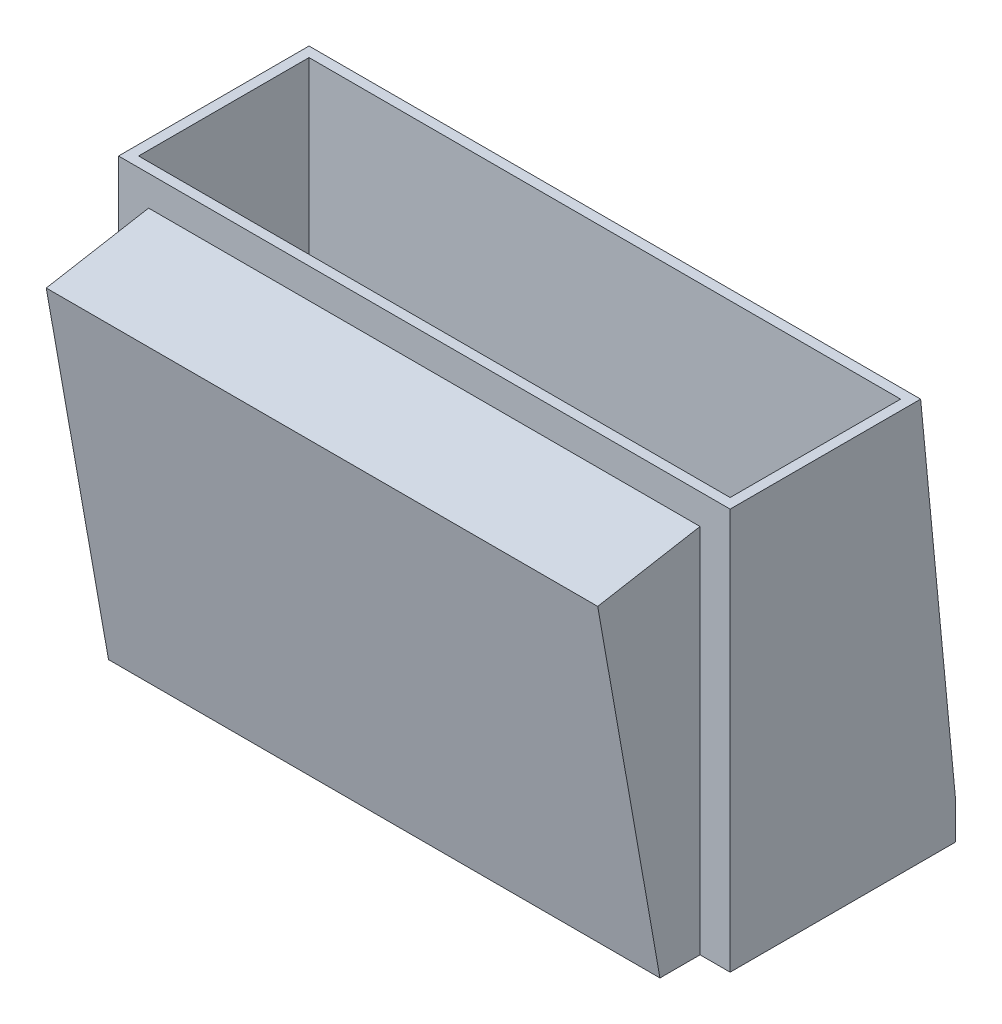
ISO-10303-21;
HEADER;
FILE_DESCRIPTION(('STEP AP214'),'2;1');
FILE_NAME('part.step','',(''),(''),'','','');
FILE_SCHEMA(('AUTOMOTIVE_DESIGN { 1 0 10303 214 1 1 1 1 }'));
ENDSEC;
DATA;
#1=APPLICATION_CONTEXT('core data for automotive mechanical design processes');
#2=APPLICATION_PROTOCOL_DEFINITION('international standard','automotive_design',2000,#1);
#3=PRODUCT_CONTEXT('',#1,'mechanical');
#4=PRODUCT('Part','Part','',(#3));
#5=PRODUCT_RELATED_PRODUCT_CATEGORY('part','',(#4));
#6=PRODUCT_DEFINITION_FORMATION('','',#4);
#7=PRODUCT_DEFINITION_CONTEXT('part definition',#1,'design');
#8=PRODUCT_DEFINITION('design','',#6,#7);
#9=PRODUCT_DEFINITION_SHAPE('','',#8);
#10=(LENGTH_UNIT() NAMED_UNIT(*) SI_UNIT(.MILLI.,.METRE.));
#11=(NAMED_UNIT(*) PLANE_ANGLE_UNIT() SI_UNIT($,.RADIAN.));
#12=(NAMED_UNIT(*) SI_UNIT($,.STERADIAN.) SOLID_ANGLE_UNIT());
#13=UNCERTAINTY_MEASURE_WITH_UNIT(LENGTH_MEASURE(1.E-05),#10,'distance_accuracy_value','');
#14=(GEOMETRIC_REPRESENTATION_CONTEXT(3) GLOBAL_UNCERTAINTY_ASSIGNED_CONTEXT((#13)) GLOBAL_UNIT_ASSIGNED_CONTEXT((#10,
#11,#12)) REPRESENTATION_CONTEXT('',''));
#15=CARTESIAN_POINT('',(0.,0.,0.));
#16=DIRECTION('',(0.,0.,1.));
#17=DIRECTION('',(1.,0.,0.));
#18=AXIS2_PLACEMENT_3D('',#15,#16,#17);
#19=CARTESIAN_POINT('',(35.3264165129139,18.7544545826681,3.30691635139591));
#20=DIRECTION('',(0.,0.984807753012208,0.173648177666931));
#21=DIRECTION('',(0.,-0.173648177666931,0.984807753012208));
#22=AXIS2_PLACEMENT_3D('',#19,#20,#21);
#23=PLANE('',#22);
#24=DIRECTION('',(-1.,0.,0.));
#25=VECTOR('',#24,1.);
#26=CARTESIAN_POINT('',(35.3264165129139,17.600136598944,9.85337894654835));
#27=LINE('',#26,#25);
#28=CARTESIAN_POINT('',(13.75,17.600136598944,9.85337894654835));
#29=VERTEX_POINT('',#28);
#30=CARTESIAN_POINT('',(-13.75,17.600136598944,9.85337894654835));
#31=VERTEX_POINT('',#30);
#32=EDGE_CURVE('E145',#29,#31,#27,.T.);
#33=ORIENTED_EDGE('',*,*,#32,.F.);
#34=DIRECTION('',(0.,0.17364817766693,-0.984807753012208));
#35=VECTOR('',#34,1.);
#36=CARTESIAN_POINT('',(13.75,18.5,4.75));
#37=LINE('',#36,#35);
#38=CARTESIAN_POINT('',(13.75,18.5,4.75));
#39=VERTEX_POINT('',#38);
#40=EDGE_CURVE('E133',#29,#39,#37,.T.);
#41=ORIENTED_EDGE('',*,*,#40,.T.);
#42=DIRECTION('',(-1.,0.,0.));
#43=VECTOR('',#42,1.);
#44=CARTESIAN_POINT('',(35.3264165129139,18.5,4.75));
#45=LINE('',#44,#43);
#46=CARTESIAN_POINT('',(-13.75,18.5,4.75));
#47=VERTEX_POINT('',#46);
#48=EDGE_CURVE('E143',#39,#47,#45,.T.);
#49=ORIENTED_EDGE('',*,*,#48,.T.);
#50=DIRECTION('',(0.,0.17364817766693,-0.984807753012208));
#51=VECTOR('',#50,1.);
#52=CARTESIAN_POINT('',(-13.75,18.5,4.75));
#53=LINE('',#52,#51);
#54=EDGE_CURVE('E281',#31,#47,#53,.T.);
#55=ORIENTED_EDGE('',*,*,#54,.F.);
#56=EDGE_LOOP('',(#33,#41,#49,#55));
#57=FACE_BOUND('',#56,.T.);
#58=ADVANCED_FACE('F35',(#57),#23,.T.);
#59=CARTESIAN_POINT('',(35.3264165129139,-1.15431798372413,6.54646259515244));
#60=DIRECTION('',(0.,-0.173648177666931,0.984807753012208));
#61=DIRECTION('',(0.,-0.984807753012208,-0.173648177666931));
#62=AXIS2_PLACEMENT_3D('',#59,#60,#61);
#63=PLANE('',#62);
#64=DIRECTION('',(-1.,0.,0.));
#65=VECTOR('',#64,1.);
#66=CARTESIAN_POINT('',(35.3264165129139,0.,6.75));
#67=LINE('',#66,#65);
#68=CARTESIAN_POINT('',(13.75,0.,6.75));
#69=VERTEX_POINT('',#68);
#70=CARTESIAN_POINT('',(-13.75,0.,6.75));
#71=VERTEX_POINT('',#70);
#72=EDGE_CURVE('E59',#69,#71,#67,.T.);
#73=ORIENTED_EDGE('',*,*,#72,.F.);
#74=DIRECTION('',(0.,0.984807753012208,0.173648177666931));
#75=VECTOR('',#74,1.);
#76=CARTESIAN_POINT('',(13.75,17.600136598944,9.85337894654835));
#77=LINE('',#76,#75);
#78=EDGE_CURVE('E52',#69,#29,#77,.T.);
#79=ORIENTED_EDGE('',*,*,#78,.T.);
#80=ORIENTED_EDGE('',*,*,#32,.T.);
#81=DIRECTION('',(0.,0.984807753012208,0.173648177666931));
#82=VECTOR('',#81,1.);
#83=CARTESIAN_POINT('',(-13.75,17.600136598944,9.85337894654835));
#84=LINE('',#83,#82);
#85=EDGE_CURVE('E283',#71,#31,#84,.T.);
#86=ORIENTED_EDGE('',*,*,#85,.F.);
#87=EDGE_LOOP('',(#73,#79,#80,#86));
#88=FACE_BOUND('',#87,.T.);
#89=ADVANCED_FACE('F231',(#88),#63,.T.);
#90=CARTESIAN_POINT('',(15.25,20.,0.));
#91=DIRECTION('',(1.,0.,0.));
#92=DIRECTION('',(0.,0.,-1.));
#93=AXIS2_PLACEMENT_3D('',#90,#91,#92);
#94=PLANE('',#93);
#95=DIRECTION('',(0.,-1.,0.));
#96=VECTOR('',#95,1.);
#97=CARTESIAN_POINT('',(15.25,20.,4.75));
#98=LINE('',#97,#96);
#99=CARTESIAN_POINT('',(15.25,20.,4.75));
#100=VERTEX_POINT('',#99);
#101=CARTESIAN_POINT('',(15.25,0.,4.75));
#102=VERTEX_POINT('',#101);
#103=EDGE_CURVE('E44',#100,#102,#98,.T.);
#104=ORIENTED_EDGE('',*,*,#103,.T.);
#105=DIRECTION('',(0.,0.,1.));
#106=VECTOR('',#105,1.);
#107=CARTESIAN_POINT('',(15.25,0.,0.));
#108=LINE('',#107,#106);
#109=CARTESIAN_POINT('',(15.25,0.,-6.5));
#110=VERTEX_POINT('',#109);
#111=EDGE_CURVE('E163',#110,#102,#108,.T.);
#112=ORIENTED_EDGE('',*,*,#111,.F.);
#113=DIRECTION('',(0.,1.,0.));
#114=VECTOR('',#113,1.);
#115=CARTESIAN_POINT('',(15.25,0.,-6.5));
#116=LINE('',#115,#114);
#117=CARTESIAN_POINT('',(15.25,1.75,-6.5));
#118=VERTEX_POINT('',#117);
#119=EDGE_CURVE('E155',#110,#118,#116,.T.);
#120=ORIENTED_EDGE('',*,*,#119,.T.);
#121=DIRECTION('',(0.,0.995433978849263,0.0954525733143129));
#122=VECTOR('',#121,1.);
#123=CARTESIAN_POINT('',(15.25,0.633553365563406,-6.60705652658981));
#124=LINE('',#123,#122);
#125=CARTESIAN_POINT('',(15.25,20.,-4.75));
#126=VERTEX_POINT('',#125);
#127=EDGE_CURVE('E151',#118,#126,#124,.T.);
#128=ORIENTED_EDGE('',*,*,#127,.T.);
#129=DIRECTION('',(0.,0.,1.));
#130=VECTOR('',#129,1.);
#131=CARTESIAN_POINT('',(15.25,20.,0.));
#132=LINE('',#131,#130);
#133=EDGE_CURVE('E179',#126,#100,#132,.T.);
#134=ORIENTED_EDGE('',*,*,#133,.T.);
#135=EDGE_LOOP('',(#104,#112,#120,#128,#134));
#136=FACE_BOUND('',#135,.T.);
#137=ADVANCED_FACE('F236',(#136),#94,.T.);
#138=CARTESIAN_POINT('',(0.,0.,0.));
#139=DIRECTION('',(0.,1.,0.));
#140=DIRECTION('',(0.,0.,1.));
#141=AXIS2_PLACEMENT_3D('',#138,#139,#140);
#142=PLANE('',#141);
#143=DIRECTION('',(1.,0.,0.));
#144=VECTOR('',#143,1.);
#145=CARTESIAN_POINT('',(0.,0.,-4.25));
#146=LINE('',#145,#144);
#147=CARTESIAN_POINT('',(-14.75,0.,-4.25));
#148=VERTEX_POINT('',#147);
#149=CARTESIAN_POINT('',(14.75,0.,-4.25));
#150=VERTEX_POINT('',#149);
#151=EDGE_CURVE('E183',#148,#150,#146,.T.);
#152=ORIENTED_EDGE('',*,*,#151,.F.);
#153=DIRECTION('',(0.,0.,1.));
#154=VECTOR('',#153,1.);
#155=CARTESIAN_POINT('',(-14.75,0.,0.));
#156=LINE('',#155,#154);
#157=CARTESIAN_POINT('',(-14.75,0.,4.25));
#158=VERTEX_POINT('',#157);
#159=EDGE_CURVE('E192',#148,#158,#156,.T.);
#160=ORIENTED_EDGE('',*,*,#159,.T.);
#161=DIRECTION('',(1.,0.,0.));
#162=VECTOR('',#161,1.);
#163=CARTESIAN_POINT('',(0.,0.,4.25));
#164=LINE('',#163,#162);
#165=CARTESIAN_POINT('',(14.75,0.,4.25));
#166=VERTEX_POINT('',#165);
#167=EDGE_CURVE('E189',#158,#166,#164,.T.);
#168=ORIENTED_EDGE('',*,*,#167,.T.);
#169=DIRECTION('',(0.,0.,1.));
#170=VECTOR('',#169,1.);
#171=CARTESIAN_POINT('',(14.75,0.,0.));
#172=LINE('',#171,#170);
#173=EDGE_CURVE('E186',#150,#166,#172,.T.);
#174=ORIENTED_EDGE('',*,*,#173,.F.);
#175=EDGE_LOOP('',(#152,#160,#168,#174));
#176=FACE_BOUND('',#175,.T.);
#177=DIRECTION('',(1.,0.,0.));
#178=VECTOR('',#177,1.);
#179=CARTESIAN_POINT('',(13.75,0.,4.75));
#180=LINE('',#179,#178);
#181=CARTESIAN_POINT('',(13.75,0.,4.75));
#182=VERTEX_POINT('',#181);
#183=EDGE_CURVE('E291',#182,#102,#180,.T.);
#184=ORIENTED_EDGE('',*,*,#183,.F.);
#185=DIRECTION('',(0.,0.,1.));
#186=VECTOR('',#185,1.);
#187=CARTESIAN_POINT('',(13.75,0.,6.75));
#188=LINE('',#187,#186);
#189=EDGE_CURVE('E134',#182,#69,#188,.T.);
#190=ORIENTED_EDGE('',*,*,#189,.T.);
#191=ORIENTED_EDGE('',*,*,#72,.T.);
#192=DIRECTION('',(0.,0.,1.));
#193=VECTOR('',#192,1.);
#194=CARTESIAN_POINT('',(-13.75,0.,6.75));
#195=LINE('',#194,#193);
#196=CARTESIAN_POINT('',(-13.75,0.,4.75));
#197=VERTEX_POINT('',#196);
#198=EDGE_CURVE('E288',#197,#71,#195,.T.);
#199=ORIENTED_EDGE('',*,*,#198,.F.);
#200=DIRECTION('',(-1.,0.,0.));
#201=VECTOR('',#200,1.);
#202=CARTESIAN_POINT('',(-13.75,0.,4.75));
#203=LINE('',#202,#201);
#204=CARTESIAN_POINT('',(-15.25,0.,4.75));
#205=VERTEX_POINT('',#204);
#206=EDGE_CURVE('E267',#197,#205,#203,.T.);
#207=ORIENTED_EDGE('',*,*,#206,.T.);
#208=DIRECTION('',(0.,0.,1.));
#209=VECTOR('',#208,1.);
#210=CARTESIAN_POINT('',(-15.25,0.,0.));
#211=LINE('',#210,#209);
#212=CARTESIAN_POINT('',(-15.25,0.,-6.5));
#213=VERTEX_POINT('',#212);
#214=EDGE_CURVE('E195',#213,#205,#211,.T.);
#215=ORIENTED_EDGE('',*,*,#214,.F.);
#216=DIRECTION('',(-1.,0.,0.));
#217=VECTOR('',#216,1.);
#218=CARTESIAN_POINT('',(35.3264165129139,0.,-6.5));
#219=LINE('',#218,#217);
#220=EDGE_CURVE('E265',#110,#213,#219,.T.);
#221=ORIENTED_EDGE('',*,*,#220,.F.);
#222=ORIENTED_EDGE('',*,*,#111,.T.);
#223=EDGE_LOOP('',(#184,#190,#191,#199,#207,#215,#221,#222));
#224=FACE_BOUND('',#223,.T.);
#225=ADVANCED_FACE('F216',(#176,#224),#142,.F.);
#226=CARTESIAN_POINT('',(-15.25,20.,0.));
#227=DIRECTION('',(1.,0.,0.));
#228=DIRECTION('',(0.,0.,-1.));
#229=AXIS2_PLACEMENT_3D('',#226,#227,#228);
#230=PLANE('',#229);
#231=ORIENTED_EDGE('',*,*,#214,.T.);
#232=DIRECTION('',(0.,-1.,0.));
#233=VECTOR('',#232,1.);
#234=CARTESIAN_POINT('',(-15.25,20.,4.75));
#235=LINE('',#234,#233);
#236=CARTESIAN_POINT('',(-15.25,20.,4.75));
#237=VERTEX_POINT('',#236);
#238=EDGE_CURVE('E11',#237,#205,#235,.T.);
#239=ORIENTED_EDGE('',*,*,#238,.F.);
#240=DIRECTION('',(0.,0.,1.));
#241=VECTOR('',#240,1.);
#242=CARTESIAN_POINT('',(-15.25,20.,0.));
#243=LINE('',#242,#241);
#244=CARTESIAN_POINT('',(-15.25,20.,-4.75));
#245=VERTEX_POINT('',#244);
#246=EDGE_CURVE('E174',#245,#237,#243,.T.);
#247=ORIENTED_EDGE('',*,*,#246,.F.);
#248=DIRECTION('',(0.,0.995433978849263,0.0954525733143129));
#249=VECTOR('',#248,1.);
#250=CARTESIAN_POINT('',(-15.25,0.633553365563406,-6.60705652658981));
#251=LINE('',#250,#249);
#252=CARTESIAN_POINT('',(-15.25,1.75,-6.5));
#253=VERTEX_POINT('',#252);
#254=EDGE_CURVE('E271',#253,#245,#251,.T.);
#255=ORIENTED_EDGE('',*,*,#254,.F.);
#256=DIRECTION('',(0.,1.,0.));
#257=VECTOR('',#256,1.);
#258=CARTESIAN_POINT('',(-15.25,0.,-6.5));
#259=LINE('',#258,#257);
#260=EDGE_CURVE('E261',#213,#253,#259,.T.);
#261=ORIENTED_EDGE('',*,*,#260,.F.);
#262=EDGE_LOOP('',(#231,#239,#247,#255,#261));
#263=FACE_BOUND('',#262,.T.);
#264=ADVANCED_FACE('F247',(#263),#230,.F.);
#265=CARTESIAN_POINT('',(0.,20.,4.75));
#266=DIRECTION('',(0.,0.,1.));
#267=DIRECTION('',(1.,0.,0.));
#268=AXIS2_PLACEMENT_3D('',#265,#266,#267);
#269=PLANE('',#268);
#270=ORIENTED_EDGE('',*,*,#48,.F.);
#271=DIRECTION('',(0.,-1.,0.));
#272=VECTOR('',#271,1.);
#273=CARTESIAN_POINT('',(13.75,0.,4.75));
#274=LINE('',#273,#272);
#275=EDGE_CURVE('E130',#39,#182,#274,.T.);
#276=ORIENTED_EDGE('',*,*,#275,.T.);
#277=ORIENTED_EDGE('',*,*,#183,.T.);
#278=ORIENTED_EDGE('',*,*,#103,.F.);
#279=DIRECTION('',(-1.,0.,0.));
#280=VECTOR('',#279,1.);
#281=CARTESIAN_POINT('',(0.,20.,4.75));
#282=LINE('',#281,#280);
#283=EDGE_CURVE('E176',#100,#237,#282,.T.);
#284=ORIENTED_EDGE('',*,*,#283,.T.);
#285=ORIENTED_EDGE('',*,*,#238,.T.);
#286=ORIENTED_EDGE('',*,*,#206,.F.);
#287=DIRECTION('',(0.,-1.,0.));
#288=VECTOR('',#287,1.);
#289=CARTESIAN_POINT('',(-13.75,0.,4.75));
#290=LINE('',#289,#288);
#291=EDGE_CURVE('E149',#47,#197,#290,.T.);
#292=ORIENTED_EDGE('',*,*,#291,.F.);
#293=EDGE_LOOP('',(#270,#276,#277,#278,#284,#285,#286,#292));
#294=FACE_BOUND('',#293,.T.);
#295=ADVANCED_FACE('F147',(#294),#269,.T.);
#296=CARTESIAN_POINT('',(0.,20.,-4.25));
#297=DIRECTION('',(0.,0.,-1.));
#298=DIRECTION('',(-1.,0.,0.));
#299=AXIS2_PLACEMENT_3D('',#296,#297,#298);
#300=PLANE('',#299);
#301=ORIENTED_EDGE('',*,*,#151,.T.);
#302=DIRECTION('',(0.,-1.,0.));
#303=VECTOR('',#302,1.);
#304=CARTESIAN_POINT('',(14.75,20.,-4.25));
#305=LINE('',#304,#303);
#306=CARTESIAN_POINT('',(14.75,20.,-4.25));
#307=VERTEX_POINT('',#306);
#308=EDGE_CURVE('E39',#307,#150,#305,.T.);
#309=ORIENTED_EDGE('',*,*,#308,.F.);
#310=DIRECTION('',(1.,0.,0.));
#311=VECTOR('',#310,1.);
#312=CARTESIAN_POINT('',(0.,20.,-4.25));
#313=LINE('',#312,#311);
#314=CARTESIAN_POINT('',(-14.75,20.,-4.25));
#315=VERTEX_POINT('',#314);
#316=EDGE_CURVE('E159',#315,#307,#313,.T.);
#317=ORIENTED_EDGE('',*,*,#316,.F.);
#318=DIRECTION('',(0.,-1.,0.));
#319=VECTOR('',#318,1.);
#320=CARTESIAN_POINT('',(-14.75,20.,-4.25));
#321=LINE('',#320,#319);
#322=EDGE_CURVE('E182',#315,#148,#321,.T.);
#323=ORIENTED_EDGE('',*,*,#322,.T.);
#324=EDGE_LOOP('',(#301,#309,#317,#323));
#325=FACE_BOUND('',#324,.T.);
#326=ADVANCED_FACE('F37',(#325),#300,.F.);
#327=CARTESIAN_POINT('',(14.75,20.,0.));
#328=DIRECTION('',(1.,0.,0.));
#329=DIRECTION('',(0.,0.,-1.));
#330=AXIS2_PLACEMENT_3D('',#327,#328,#329);
#331=PLANE('',#330);
#332=ORIENTED_EDGE('',*,*,#173,.T.);
#333=DIRECTION('',(0.,-1.,0.));
#334=VECTOR('',#333,1.);
#335=CARTESIAN_POINT('',(14.75,20.,4.25));
#336=LINE('',#335,#334);
#337=CARTESIAN_POINT('',(14.75,20.,4.25));
#338=VERTEX_POINT('',#337);
#339=EDGE_CURVE('E203',#338,#166,#336,.T.);
#340=ORIENTED_EDGE('',*,*,#339,.F.);
#341=DIRECTION('',(0.,0.,1.));
#342=VECTOR('',#341,1.);
#343=CARTESIAN_POINT('',(14.75,20.,0.));
#344=LINE('',#343,#342);
#345=EDGE_CURVE('E162',#307,#338,#344,.T.);
#346=ORIENTED_EDGE('',*,*,#345,.F.);
#347=ORIENTED_EDGE('',*,*,#308,.T.);
#348=EDGE_LOOP('',(#332,#340,#346,#347));
#349=FACE_BOUND('',#348,.T.);
#350=ADVANCED_FACE('F210',(#349),#331,.F.);
#351=CARTESIAN_POINT('',(0.,20.,4.25));
#352=DIRECTION('',(0.,0.,-1.));
#353=DIRECTION('',(-1.,0.,0.));
#354=AXIS2_PLACEMENT_3D('',#351,#352,#353);
#355=PLANE('',#354);
#356=ORIENTED_EDGE('',*,*,#167,.F.);
#357=DIRECTION('',(0.,-1.,0.));
#358=VECTOR('',#357,1.);
#359=CARTESIAN_POINT('',(-14.75,20.,4.25));
#360=LINE('',#359,#358);
#361=CARTESIAN_POINT('',(-14.75,20.,4.25));
#362=VERTEX_POINT('',#361);
#363=EDGE_CURVE('E202',#362,#158,#360,.T.);
#364=ORIENTED_EDGE('',*,*,#363,.F.);
#365=DIRECTION('',(1.,0.,0.));
#366=VECTOR('',#365,1.);
#367=CARTESIAN_POINT('',(0.,20.,4.25));
#368=LINE('',#367,#366);
#369=EDGE_CURVE('E165',#362,#338,#368,.T.);
#370=ORIENTED_EDGE('',*,*,#369,.T.);
#371=ORIENTED_EDGE('',*,*,#339,.T.);
#372=EDGE_LOOP('',(#356,#364,#370,#371));
#373=FACE_BOUND('',#372,.T.);
#374=ADVANCED_FACE('F221',(#373),#355,.T.);
#375=CARTESIAN_POINT('',(-14.75,20.,0.));
#376=DIRECTION('',(1.,0.,0.));
#377=DIRECTION('',(0.,0.,-1.));
#378=AXIS2_PLACEMENT_3D('',#375,#376,#377);
#379=PLANE('',#378);
#380=ORIENTED_EDGE('',*,*,#159,.F.);
#381=ORIENTED_EDGE('',*,*,#322,.F.);
#382=DIRECTION('',(0.,0.,1.));
#383=VECTOR('',#382,1.);
#384=CARTESIAN_POINT('',(-14.75,20.,0.));
#385=LINE('',#384,#383);
#386=EDGE_CURVE('E168',#315,#362,#385,.T.);
#387=ORIENTED_EDGE('',*,*,#386,.T.);
#388=ORIENTED_EDGE('',*,*,#363,.T.);
#389=EDGE_LOOP('',(#380,#381,#387,#388));
#390=FACE_BOUND('',#389,.T.);
#391=ADVANCED_FACE('F218',(#390),#379,.T.);
#392=CARTESIAN_POINT('',(0.,20.,0.));
#393=DIRECTION('',(0.,1.,0.));
#394=DIRECTION('',(0.,0.,1.));
#395=AXIS2_PLACEMENT_3D('',#392,#393,#394);
#396=PLANE('',#395);
#397=ORIENTED_EDGE('',*,*,#316,.T.);
#398=ORIENTED_EDGE('',*,*,#345,.T.);
#399=ORIENTED_EDGE('',*,*,#369,.F.);
#400=ORIENTED_EDGE('',*,*,#386,.F.);
#401=EDGE_LOOP('',(#397,#398,#399,#400));
#402=FACE_BOUND('',#401,.T.);
#403=DIRECTION('',(-1.,0.,0.));
#404=VECTOR('',#403,1.);
#405=CARTESIAN_POINT('',(0.,20.,-4.75));
#406=LINE('',#405,#404);
#407=EDGE_CURVE('E171',#126,#245,#406,.T.);
#408=ORIENTED_EDGE('',*,*,#407,.T.);
#409=ORIENTED_EDGE('',*,*,#246,.T.);
#410=ORIENTED_EDGE('',*,*,#283,.F.);
#411=ORIENTED_EDGE('',*,*,#133,.F.);
#412=EDGE_LOOP('',(#408,#409,#410,#411));
#413=FACE_BOUND('',#412,.T.);
#414=ADVANCED_FACE('F228',(#402,#413),#396,.T.);
#415=CARTESIAN_POINT('',(35.3264165129139,0.633553365563406,-6.60705652658981));
#416=DIRECTION('',(0.,-0.0954525733143129,0.995433978849263));
#417=DIRECTION('',(0.,-0.995433978849263,-0.0954525733143129));
#418=AXIS2_PLACEMENT_3D('',#415,#416,#417);
#419=PLANE('',#418);
#420=ORIENTED_EDGE('',*,*,#127,.F.);
#421=DIRECTION('',(-1.,0.,0.));
#422=VECTOR('',#421,1.);
#423=CARTESIAN_POINT('',(35.3264165129139,1.75,-6.5));
#424=LINE('',#423,#422);
#425=EDGE_CURVE('E275',#118,#253,#424,.T.);
#426=ORIENTED_EDGE('',*,*,#425,.T.);
#427=ORIENTED_EDGE('',*,*,#254,.T.);
#428=ORIENTED_EDGE('',*,*,#407,.F.);
#429=EDGE_LOOP('',(#420,#426,#427,#428));
#430=FACE_BOUND('',#429,.T.);
#431=ADVANCED_FACE('F243',(#430),#419,.F.);
#432=CARTESIAN_POINT('',(35.3264165129139,0.,-6.5));
#433=DIRECTION('',(0.,0.,1.));
#434=DIRECTION('',(1.,0.,0.));
#435=AXIS2_PLACEMENT_3D('',#432,#433,#434);
#436=PLANE('',#435);
#437=ORIENTED_EDGE('',*,*,#119,.F.);
#438=ORIENTED_EDGE('',*,*,#220,.T.);
#439=ORIENTED_EDGE('',*,*,#260,.T.);
#440=ORIENTED_EDGE('',*,*,#425,.F.);
#441=EDGE_LOOP('',(#437,#438,#439,#440));
#442=FACE_BOUND('',#441,.T.);
#443=ADVANCED_FACE('F269',(#442),#436,.F.);
#444=CARTESIAN_POINT('',(-13.75,0.,0.));
#445=DIRECTION('',(-1.,0.,0.));
#446=DIRECTION('',(0.,0.,1.));
#447=AXIS2_PLACEMENT_3D('',#444,#445,#446);
#448=PLANE('',#447);
#449=ORIENTED_EDGE('',*,*,#291,.T.);
#450=ORIENTED_EDGE('',*,*,#198,.T.);
#451=ORIENTED_EDGE('',*,*,#85,.T.);
#452=ORIENTED_EDGE('',*,*,#54,.T.);
#453=EDGE_LOOP('',(#449,#450,#451,#452));
#454=FACE_BOUND('',#453,.T.);
#455=ADVANCED_FACE('F296',(#454),#448,.T.);
#456=CARTESIAN_POINT('',(13.75,0.,0.));
#457=DIRECTION('',(1.,0.,0.));
#458=DIRECTION('',(0.,0.,1.));
#459=AXIS2_PLACEMENT_3D('',#456,#457,#458);
#460=PLANE('',#459);
#461=ORIENTED_EDGE('',*,*,#275,.F.);
#462=ORIENTED_EDGE('',*,*,#40,.F.);
#463=ORIENTED_EDGE('',*,*,#78,.F.);
#464=ORIENTED_EDGE('',*,*,#189,.F.);
#465=EDGE_LOOP('',(#461,#462,#463,#464));
#466=FACE_BOUND('',#465,.T.);
#467=ADVANCED_FACE('F132',(#466),#460,.T.);
#468=CLOSED_SHELL('',(#58,#89,#137,#225,#264,#295,#326,#350,#374,#391,#414,#431,#443,#455,#467));
#469=MANIFOLD_SOLID_BREP('B2',#468);
#470=ADVANCED_BREP_SHAPE_REPRESENTATION('',(#18,#469),#14);
#471=SHAPE_DEFINITION_REPRESENTATION(#9,#470);
ENDSEC;
END-ISO-10303-21;
